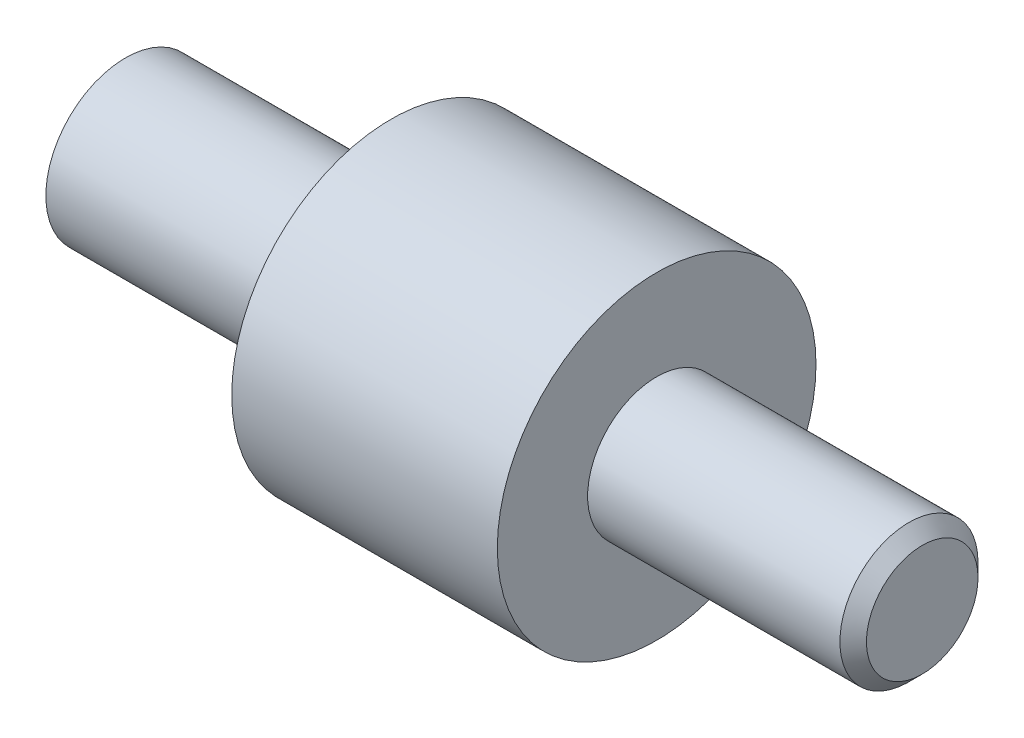
ISO-10303-21;
HEADER;
FILE_DESCRIPTION(('STEP AP214'),'2;1');
FILE_NAME('part.step','',(''),(''),'','','');
FILE_SCHEMA(('AUTOMOTIVE_DESIGN { 1 0 10303 214 1 1 1 1 }'));
ENDSEC;
DATA;
#1=APPLICATION_CONTEXT('core data for automotive mechanical design processes');
#2=APPLICATION_PROTOCOL_DEFINITION('international standard','automotive_design',2000,#1);
#3=PRODUCT_CONTEXT('',#1,'mechanical');
#4=PRODUCT('Part','Part','',(#3));
#5=PRODUCT_RELATED_PRODUCT_CATEGORY('part','',(#4));
#6=PRODUCT_DEFINITION_FORMATION('','',#4);
#7=PRODUCT_DEFINITION_CONTEXT('part definition',#1,'design');
#8=PRODUCT_DEFINITION('design','',#6,#7);
#9=PRODUCT_DEFINITION_SHAPE('','',#8);
#10=(LENGTH_UNIT() NAMED_UNIT(*) SI_UNIT(.MILLI.,.METRE.));
#11=(NAMED_UNIT(*) PLANE_ANGLE_UNIT() SI_UNIT($,.RADIAN.));
#12=(NAMED_UNIT(*) SI_UNIT($,.STERADIAN.) SOLID_ANGLE_UNIT());
#13=UNCERTAINTY_MEASURE_WITH_UNIT(LENGTH_MEASURE(1.E-05),#10,'distance_accuracy_value','');
#14=(GEOMETRIC_REPRESENTATION_CONTEXT(3) GLOBAL_UNCERTAINTY_ASSIGNED_CONTEXT((#13)) GLOBAL_UNIT_ASSIGNED_CONTEXT((#10,
#11,#12)) REPRESENTATION_CONTEXT('',''));
#15=CARTESIAN_POINT('',(0.,0.,0.));
#16=DIRECTION('',(0.,0.,1.));
#17=DIRECTION('',(1.,0.,0.));
#18=AXIS2_PLACEMENT_3D('',#15,#16,#17);
#19=CARTESIAN_POINT('',(0.,0.,0.));
#20=DIRECTION('',(-1.,0.,0.));
#21=DIRECTION('',(0.,0.,1.));
#22=AXIS2_PLACEMENT_3D('',#19,#20,#21);
#23=PLANE('',#22);
#24=CARTESIAN_POINT('',(0.,0.,0.));
#25=DIRECTION('',(1.,0.,0.));
#26=DIRECTION('',(0.,0.,-1.));
#27=AXIS2_PLACEMENT_3D('',#24,#25,#26);
#28=CIRCLE('',#27,1.5);
#29=CARTESIAN_POINT('',(0.,0.,-1.5));
#30=VERTEX_POINT('',#29);
#31=EDGE_CURVE('E47',#30,#30,#28,.T.);
#32=ORIENTED_EDGE('',*,*,#31,.F.);
#33=EDGE_LOOP('',(#32));
#34=FACE_BOUND('',#33,.T.);
#35=ADVANCED_FACE('F35',(#34),#23,.T.);
#36=CARTESIAN_POINT('',(15.,0.,0.));
#37=DIRECTION('',(1.,0.,0.));
#38=DIRECTION('',(0.,0.,-1.));
#39=AXIS2_PLACEMENT_3D('',#36,#37,#38);
#40=CYLINDRICAL_SURFACE('',#39,1.5);
#41=ORIENTED_EDGE('',*,*,#31,.T.);
#42=EDGE_LOOP('',(#41));
#43=FACE_BOUND('',#42,.T.);
#44=CARTESIAN_POINT('',(5.,0.,0.));
#45=DIRECTION('',(1.,0.,0.));
#46=DIRECTION('',(0.,0.,-1.));
#47=AXIS2_PLACEMENT_3D('',#44,#45,#46);
#48=CIRCLE('',#47,1.5);
#49=CARTESIAN_POINT('',(5.,0.,-1.5));
#50=VERTEX_POINT('',#49);
#51=EDGE_CURVE('E51',#50,#50,#48,.T.);
#52=ORIENTED_EDGE('',*,*,#51,.F.);
#53=EDGE_LOOP('',(#52));
#54=FACE_BOUND('',#53,.T.);
#55=ADVANCED_FACE('F83',(#43,#54),#40,.T.);
#56=CARTESIAN_POINT('',(5.,1.5,0.));
#57=DIRECTION('',(-1.,0.,0.));
#58=DIRECTION('',(0.,0.,1.));
#59=AXIS2_PLACEMENT_3D('',#56,#57,#58);
#60=PLANE('',#59);
#61=ORIENTED_EDGE('',*,*,#51,.T.);
#62=EDGE_LOOP('',(#61));
#63=FACE_BOUND('',#62,.T.);
#64=CARTESIAN_POINT('',(5.,0.,0.));
#65=DIRECTION('',(1.,0.,0.));
#66=DIRECTION('',(0.,0.,-1.));
#67=AXIS2_PLACEMENT_3D('',#64,#65,#66);
#68=CIRCLE('',#67,3.);
#69=CARTESIAN_POINT('',(5.,0.,-3.));
#70=VERTEX_POINT('',#69);
#71=EDGE_CURVE('E56',#70,#70,#68,.T.);
#72=ORIENTED_EDGE('',*,*,#71,.F.);
#73=EDGE_LOOP('',(#72));
#74=FACE_BOUND('',#73,.T.);
#75=ADVANCED_FACE('F79',(#63,#74),#60,.T.);
#76=CARTESIAN_POINT('',(15.,0.,0.));
#77=DIRECTION('',(1.,0.,0.));
#78=DIRECTION('',(0.,0.,-1.));
#79=AXIS2_PLACEMENT_3D('',#76,#77,#78);
#80=CYLINDRICAL_SURFACE('',#79,3.);
#81=ORIENTED_EDGE('',*,*,#71,.T.);
#82=EDGE_LOOP('',(#81));
#83=FACE_BOUND('',#82,.T.);
#84=CARTESIAN_POINT('',(10.,0.,0.));
#85=DIRECTION('',(1.,0.,0.));
#86=DIRECTION('',(0.,0.,-1.));
#87=AXIS2_PLACEMENT_3D('',#84,#85,#86);
#88=CIRCLE('',#87,3.);
#89=CARTESIAN_POINT('',(10.,0.,-3.));
#90=VERTEX_POINT('',#89);
#91=EDGE_CURVE('E59',#90,#90,#88,.T.);
#92=ORIENTED_EDGE('',*,*,#91,.F.);
#93=EDGE_LOOP('',(#92));
#94=FACE_BOUND('',#93,.T.);
#95=ADVANCED_FACE('F70',(#83,#94),#80,.T.);
#96=CARTESIAN_POINT('',(10.,3.,0.));
#97=DIRECTION('',(1.,0.,0.));
#98=DIRECTION('',(0.,0.,-1.));
#99=AXIS2_PLACEMENT_3D('',#96,#97,#98);
#100=PLANE('',#99);
#101=ORIENTED_EDGE('',*,*,#91,.T.);
#102=EDGE_LOOP('',(#101));
#103=FACE_BOUND('',#102,.T.);
#104=CARTESIAN_POINT('',(10.,0.,0.));
#105=DIRECTION('',(1.,0.,0.));
#106=DIRECTION('',(0.,0.,-1.));
#107=AXIS2_PLACEMENT_3D('',#104,#105,#106);
#108=CIRCLE('',#107,1.3);
#109=CARTESIAN_POINT('',(10.,0.,-1.3));
#110=VERTEX_POINT('',#109);
#111=EDGE_CURVE('E62',#110,#110,#108,.T.);
#112=ORIENTED_EDGE('',*,*,#111,.F.);
#113=EDGE_LOOP('',(#112));
#114=FACE_BOUND('',#113,.T.);
#115=ADVANCED_FACE('F68',(#103,#114),#100,.T.);
#116=CARTESIAN_POINT('',(15.,0.,0.));
#117=DIRECTION('',(1.,0.,0.));
#118=DIRECTION('',(0.,0.,-1.));
#119=AXIS2_PLACEMENT_3D('',#116,#117,#118);
#120=CYLINDRICAL_SURFACE('',#119,1.3);
#121=CARTESIAN_POINT('',(14.75,0.,0.));
#122=DIRECTION('',(1.,0.,0.));
#123=DIRECTION('',(0.,0.,-1.));
#124=AXIS2_PLACEMENT_3D('',#121,#122,#123);
#125=CIRCLE('',#124,1.3);
#126=CARTESIAN_POINT('',(14.75,0.,-1.3));
#127=VERTEX_POINT('',#126);
#128=EDGE_CURVE('E10',#127,#127,#125,.F.);
#129=ORIENTED_EDGE('',*,*,#128,.T.);
#130=EDGE_LOOP('',(#129));
#131=FACE_BOUND('',#130,.T.);
#132=ORIENTED_EDGE('',*,*,#111,.T.);
#133=EDGE_LOOP('',(#132));
#134=FACE_BOUND('',#133,.T.);
#135=ADVANCED_FACE('F66',(#131,#134),#120,.T.);
#136=CARTESIAN_POINT('',(15.,1.3,0.));
#137=DIRECTION('',(1.,0.,0.));
#138=DIRECTION('',(0.,0.,-1.));
#139=AXIS2_PLACEMENT_3D('',#136,#137,#138);
#140=PLANE('',#139);
#141=CARTESIAN_POINT('',(15.,0.,0.));
#142=DIRECTION('',(1.,0.,0.));
#143=DIRECTION('',(0.,0.,-1.));
#144=AXIS2_PLACEMENT_3D('',#141,#142,#143);
#145=CIRCLE('',#144,1.05);
#146=CARTESIAN_POINT('',(15.,0.,-1.05));
#147=VERTEX_POINT('',#146);
#148=EDGE_CURVE('E43',#147,#147,#145,.T.);
#149=ORIENTED_EDGE('',*,*,#148,.T.);
#150=EDGE_LOOP('',(#149));
#151=FACE_BOUND('',#150,.T.);
#152=ADVANCED_FACE('F77',(#151),#140,.T.);
#153=CARTESIAN_POINT('',(15.,0.,0.));
#154=DIRECTION('',(-1.,0.,0.));
#155=DIRECTION('',(0.,0.,1.));
#156=AXIS2_PLACEMENT_3D('',#153,#154,#155);
#157=CONICAL_SURFACE('',#156,1.05,0.785398163397443);
#158=ORIENTED_EDGE('',*,*,#128,.F.);
#159=EDGE_LOOP('',(#158));
#160=FACE_BOUND('',#159,.T.);
#161=ORIENTED_EDGE('',*,*,#148,.F.);
#162=EDGE_LOOP('',(#161));
#163=FACE_BOUND('',#162,.T.);
#164=ADVANCED_FACE('F38',(#160,#163),#157,.T.);
#165=CLOSED_SHELL('',(#35,#55,#75,#95,#115,#135,#152,#164));
#166=MANIFOLD_SOLID_BREP('B2',#165);
#167=ADVANCED_BREP_SHAPE_REPRESENTATION('',(#18,#166),#14);
#168=SHAPE_DEFINITION_REPRESENTATION(#9,#167);
ENDSEC;
END-ISO-10303-21;
